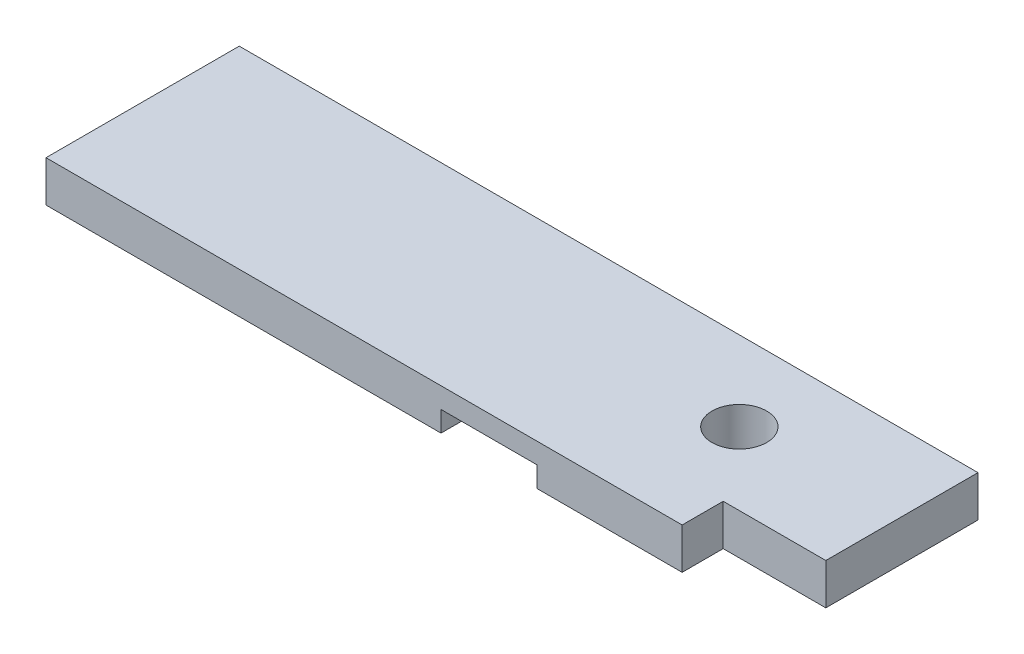
ISO-10303-21;
HEADER;
FILE_DESCRIPTION(('STEP AP214'),'2;1');
FILE_NAME('part.step','',(''),(''),'','','');
FILE_SCHEMA(('AUTOMOTIVE_DESIGN { 1 0 10303 214 1 1 1 1 }'));
ENDSEC;
DATA;
#1=APPLICATION_CONTEXT('core data for automotive mechanical design processes');
#2=APPLICATION_PROTOCOL_DEFINITION('international standard','automotive_design',2000,#1);
#3=PRODUCT_CONTEXT('',#1,'mechanical');
#4=PRODUCT('Part','Part','',(#3));
#5=PRODUCT_RELATED_PRODUCT_CATEGORY('part','',(#4));
#6=PRODUCT_DEFINITION_FORMATION('','',#4);
#7=PRODUCT_DEFINITION_CONTEXT('part definition',#1,'design');
#8=PRODUCT_DEFINITION('design','',#6,#7);
#9=PRODUCT_DEFINITION_SHAPE('','',#8);
#10=(LENGTH_UNIT() NAMED_UNIT(*) SI_UNIT(.MILLI.,.METRE.));
#11=(NAMED_UNIT(*) PLANE_ANGLE_UNIT() SI_UNIT($,.RADIAN.));
#12=(NAMED_UNIT(*) SI_UNIT($,.STERADIAN.) SOLID_ANGLE_UNIT());
#13=UNCERTAINTY_MEASURE_WITH_UNIT(LENGTH_MEASURE(1.E-05),#10,'distance_accuracy_value','');
#14=(GEOMETRIC_REPRESENTATION_CONTEXT(3) GLOBAL_UNCERTAINTY_ASSIGNED_CONTEXT((#13)) GLOBAL_UNIT_ASSIGNED_CONTEXT((#10,
#11,#12)) REPRESENTATION_CONTEXT('',''));
#15=CARTESIAN_POINT('',(0.,0.,0.));
#16=DIRECTION('',(0.,0.,1.));
#17=DIRECTION('',(1.,0.,0.));
#18=AXIS2_PLACEMENT_3D('',#15,#16,#17);
#19=CARTESIAN_POINT('',(0.,0.,0.));
#20=DIRECTION('',(0.,-1.,0.));
#21=DIRECTION('',(0.,0.,-1.));
#22=AXIS2_PLACEMENT_3D('',#19,#20,#21);
#23=PLANE('',#22);
#24=DIRECTION('',(0.,0.,-1.));
#25=VECTOR('',#24,1.);
#26=CARTESIAN_POINT('',(366.70104079,0.,179.400200000003));
#27=LINE('',#26,#25);
#28=CARTESIAN_POINT('',(366.70104079,0.,179.400200000003));
#29=VERTEX_POINT('',#28);
#30=CARTESIAN_POINT('',(366.70104079,0.,0.));
#31=VERTEX_POINT('',#30);
#32=EDGE_CURVE('E201',#29,#31,#27,.T.);
#33=ORIENTED_EDGE('',*,*,#32,.F.);
#34=DIRECTION('',(1.,0.,0.));
#35=VECTOR('',#34,1.);
#36=CARTESIAN_POINT('',(590.5627,0.,179.400200000003));
#37=LINE('',#36,#35);
#38=CARTESIAN_POINT('',(0.,0.,179.400200000003));
#39=VERTEX_POINT('',#38);
#40=EDGE_CURVE('E145',#39,#29,#37,.T.);
#41=ORIENTED_EDGE('',*,*,#40,.F.);
#42=DIRECTION('',(0.,0.,1.));
#43=VECTOR('',#42,1.);
#44=CARTESIAN_POINT('',(0.,0.,0.));
#45=LINE('',#44,#43);
#46=CARTESIAN_POINT('',(0.,0.,0.));
#47=VERTEX_POINT('',#46);
#48=EDGE_CURVE('E140',#47,#39,#45,.T.);
#49=ORIENTED_EDGE('',*,*,#48,.F.);
#50=DIRECTION('',(-1.,0.,0.));
#51=VECTOR('',#50,1.);
#52=CARTESIAN_POINT('',(685.812700000001,0.,0.));
#53=LINE('',#52,#51);
#54=EDGE_CURVE('E92',#31,#47,#53,.T.);
#55=ORIENTED_EDGE('',*,*,#54,.F.);
#56=EDGE_LOOP('',(#33,#41,#49,#55));
#57=FACE_BOUND('',#56,.T.);
#58=ADVANCED_FACE('F41',(#57),#23,.T.);
#59=CARTESIAN_POINT('',(0.,38.1,0.));
#60=DIRECTION('',(0.,-1.,0.));
#61=DIRECTION('',(0.,0.,-1.));
#62=AXIS2_PLACEMENT_3D('',#59,#60,#61);
#63=PLANE('',#62);
#64=DIRECTION('',(0.,0.,1.));
#65=VECTOR('',#64,1.);
#66=CARTESIAN_POINT('',(0.,38.1,0.));
#67=LINE('',#66,#65);
#68=CARTESIAN_POINT('',(0.,38.1,0.));
#69=VERTEX_POINT('',#68);
#70=CARTESIAN_POINT('',(0.,38.1,179.400200000003));
#71=VERTEX_POINT('',#70);
#72=EDGE_CURVE('E156',#69,#71,#67,.T.);
#73=ORIENTED_EDGE('',*,*,#72,.T.);
#74=DIRECTION('',(1.,0.,0.));
#75=VECTOR('',#74,1.);
#76=CARTESIAN_POINT('',(590.5627,38.1,179.400200000003));
#77=LINE('',#76,#75);
#78=CARTESIAN_POINT('',(590.5627,38.1,179.400200000003));
#79=VERTEX_POINT('',#78);
#80=EDGE_CURVE('E100',#71,#79,#77,.T.);
#81=ORIENTED_EDGE('',*,*,#80,.T.);
#82=DIRECTION('',(0.,0.,-1.));
#83=VECTOR('',#82,1.);
#84=CARTESIAN_POINT('',(590.5627,38.1,141.2875));
#85=LINE('',#84,#83);
#86=CARTESIAN_POINT('',(590.5627,38.1,141.2875));
#87=VERTEX_POINT('',#86);
#88=EDGE_CURVE('E118',#79,#87,#85,.T.);
#89=ORIENTED_EDGE('',*,*,#88,.T.);
#90=DIRECTION('',(1.,0.,0.));
#91=VECTOR('',#90,1.);
#92=CARTESIAN_POINT('',(685.812700000001,38.1,141.2875));
#93=LINE('',#92,#91);
#94=CARTESIAN_POINT('',(685.812700000001,38.1,141.2875));
#95=VERTEX_POINT('',#94);
#96=EDGE_CURVE('E110',#87,#95,#93,.T.);
#97=ORIENTED_EDGE('',*,*,#96,.T.);
#98=DIRECTION('',(0.,0.,-1.));
#99=VECTOR('',#98,1.);
#100=CARTESIAN_POINT('',(685.812700000001,38.1,0.));
#101=LINE('',#100,#99);
#102=CARTESIAN_POINT('',(685.812700000001,38.1,0.));
#103=VERTEX_POINT('',#102);
#104=EDGE_CURVE('E115',#95,#103,#101,.T.);
#105=ORIENTED_EDGE('',*,*,#104,.T.);
#106=DIRECTION('',(-1.,0.,0.));
#107=VECTOR('',#106,1.);
#108=CARTESIAN_POINT('',(685.812700000001,38.1,0.));
#109=LINE('',#108,#107);
#110=EDGE_CURVE('E65',#103,#69,#109,.T.);
#111=ORIENTED_EDGE('',*,*,#110,.T.);
#112=EDGE_LOOP('',(#73,#81,#89,#97,#105,#111));
#113=FACE_BOUND('',#112,.T.);
#114=CARTESIAN_POINT('',(538.175199999999,38.1,73.9181909999946));
#115=DIRECTION('',(0.,1.,0.));
#116=DIRECTION('',(0.,0.,1.));
#117=AXIS2_PLACEMENT_3D('',#114,#115,#116);
#118=CIRCLE('',#117,25.4);
#119=CARTESIAN_POINT('',(538.175199999999,38.1,99.3181909999946));
#120=VERTEX_POINT('',#119);
#121=EDGE_CURVE('E144',#120,#120,#118,.T.);
#122=ORIENTED_EDGE('',*,*,#121,.F.);
#123=EDGE_LOOP('',(#122));
#124=FACE_BOUND('',#123,.T.);
#125=ADVANCED_FACE('F112',(#113,#124),#63,.F.);
#126=DIRECTION('',(0.,0.,1.));
#127=VECTOR('',#126,1.);
#128=CARTESIAN_POINT('',(455.60104079,0.,179.400200000003));
#129=LINE('',#128,#127);
#130=CARTESIAN_POINT('',(455.60104079,0.,0.));
#131=VERTEX_POINT('',#130);
#132=CARTESIAN_POINT('',(455.60104079,0.,179.400200000003));
#133=VERTEX_POINT('',#132);
#134=EDGE_CURVE('E198',#131,#133,#129,.T.);
#135=ORIENTED_EDGE('',*,*,#134,.F.);
#136=CARTESIAN_POINT('',(685.812700000001,0.,0.));
#137=VERTEX_POINT('',#136);
#138=EDGE_CURVE('E153',#137,#131,#53,.T.);
#139=ORIENTED_EDGE('',*,*,#138,.F.);
#140=DIRECTION('',(0.,0.,-1.));
#141=VECTOR('',#140,1.);
#142=CARTESIAN_POINT('',(685.812700000001,0.,0.));
#143=LINE('',#142,#141);
#144=CARTESIAN_POINT('',(685.812700000001,0.,141.2875));
#145=VERTEX_POINT('',#144);
#146=EDGE_CURVE('E151',#145,#137,#143,.T.);
#147=ORIENTED_EDGE('',*,*,#146,.F.);
#148=DIRECTION('',(1.,0.,0.));
#149=VECTOR('',#148,1.);
#150=CARTESIAN_POINT('',(685.812700000001,0.,141.2875));
#151=LINE('',#150,#149);
#152=CARTESIAN_POINT('',(590.5627,0.,141.2875));
#153=VERTEX_POINT('',#152);
#154=EDGE_CURVE('E127',#153,#145,#151,.T.);
#155=ORIENTED_EDGE('',*,*,#154,.F.);
#156=DIRECTION('',(0.,0.,-1.));
#157=VECTOR('',#156,1.);
#158=CARTESIAN_POINT('',(590.5627,0.,141.2875));
#159=LINE('',#158,#157);
#160=CARTESIAN_POINT('',(590.5627,0.,179.400200000003));
#161=VERTEX_POINT('',#160);
#162=EDGE_CURVE('E148',#161,#153,#159,.T.);
#163=ORIENTED_EDGE('',*,*,#162,.F.);
#164=EDGE_CURVE('E143',#133,#161,#37,.T.);
#165=ORIENTED_EDGE('',*,*,#164,.F.);
#166=EDGE_LOOP('',(#135,#139,#147,#155,#163,#165));
#167=FACE_BOUND('',#166,.T.);
#168=CARTESIAN_POINT('',(538.175199999999,0.,73.9181909999946));
#169=DIRECTION('',(0.,1.,0.));
#170=DIRECTION('',(0.,0.,1.));
#171=AXIS2_PLACEMENT_3D('',#168,#169,#170);
#172=CIRCLE('',#171,25.4);
#173=CARTESIAN_POINT('',(538.175199999999,0.,99.3181909999946));
#174=VERTEX_POINT('',#173);
#175=EDGE_CURVE('E181',#174,#174,#172,.T.);
#176=ORIENTED_EDGE('',*,*,#175,.T.);
#177=EDGE_LOOP('',(#176));
#178=FACE_BOUND('',#177,.T.);
#179=ADVANCED_FACE('F166',(#167,#178),#23,.T.);
#180=CARTESIAN_POINT('',(0.,38.1,0.));
#181=DIRECTION('',(1.,0.,0.));
#182=DIRECTION('',(0.,0.,-1.));
#183=AXIS2_PLACEMENT_3D('',#180,#181,#182);
#184=PLANE('',#183);
#185=ORIENTED_EDGE('',*,*,#48,.T.);
#186=DIRECTION('',(0.,-1.,0.));
#187=VECTOR('',#186,1.);
#188=CARTESIAN_POINT('',(0.,38.1,179.400200000003));
#189=LINE('',#188,#187);
#190=EDGE_CURVE('E11',#71,#39,#189,.T.);
#191=ORIENTED_EDGE('',*,*,#190,.F.);
#192=ORIENTED_EDGE('',*,*,#72,.F.);
#193=DIRECTION('',(0.,-1.,0.));
#194=VECTOR('',#193,1.);
#195=CARTESIAN_POINT('',(0.,38.1,0.));
#196=LINE('',#195,#194);
#197=EDGE_CURVE('E136',#69,#47,#196,.T.);
#198=ORIENTED_EDGE('',*,*,#197,.T.);
#199=EDGE_LOOP('',(#185,#191,#192,#198));
#200=FACE_BOUND('',#199,.T.);
#201=ADVANCED_FACE('F43',(#200),#184,.F.);
#202=CARTESIAN_POINT('',(590.5627,38.1,179.400200000003));
#203=DIRECTION('',(0.,0.,-1.));
#204=DIRECTION('',(-1.,0.,0.));
#205=AXIS2_PLACEMENT_3D('',#202,#203,#204);
#206=PLANE('',#205);
#207=ORIENTED_EDGE('',*,*,#40,.T.);
#208=DIRECTION('',(0.,-1.,0.));
#209=VECTOR('',#208,1.);
#210=CARTESIAN_POINT('',(366.70104079,19.05,179.400200000003));
#211=LINE('',#210,#209);
#212=CARTESIAN_POINT('',(366.70104079,19.05,179.400200000003));
#213=VERTEX_POINT('',#212);
#214=EDGE_CURVE('E184',#213,#29,#211,.T.);
#215=ORIENTED_EDGE('',*,*,#214,.F.);
#216=DIRECTION('',(-1.,0.,0.));
#217=VECTOR('',#216,1.);
#218=CARTESIAN_POINT('',(366.70104079,19.05,179.400200000003));
#219=LINE('',#218,#217);
#220=CARTESIAN_POINT('',(455.60104079,19.05,179.400200000003));
#221=VERTEX_POINT('',#220);
#222=EDGE_CURVE('E190',#221,#213,#219,.T.);
#223=ORIENTED_EDGE('',*,*,#222,.F.);
#224=DIRECTION('',(0.,-1.,0.));
#225=VECTOR('',#224,1.);
#226=CARTESIAN_POINT('',(455.60104079,19.05,179.400200000003));
#227=LINE('',#226,#225);
#228=EDGE_CURVE('E193',#221,#133,#227,.T.);
#229=ORIENTED_EDGE('',*,*,#228,.T.);
#230=ORIENTED_EDGE('',*,*,#164,.T.);
#231=DIRECTION('',(0.,-1.,0.));
#232=VECTOR('',#231,1.);
#233=CARTESIAN_POINT('',(590.5627,38.1,179.400200000003));
#234=LINE('',#233,#232);
#235=EDGE_CURVE('E49',#79,#161,#234,.T.);
#236=ORIENTED_EDGE('',*,*,#235,.F.);
#237=ORIENTED_EDGE('',*,*,#80,.F.);
#238=ORIENTED_EDGE('',*,*,#190,.T.);
#239=EDGE_LOOP('',(#207,#215,#223,#229,#230,#236,#237,#238));
#240=FACE_BOUND('',#239,.T.);
#241=ADVANCED_FACE('F224',(#240),#206,.F.);
#242=CARTESIAN_POINT('',(590.5627,38.1,141.2875));
#243=DIRECTION('',(-1.,0.,0.));
#244=DIRECTION('',(0.,0.,1.));
#245=AXIS2_PLACEMENT_3D('',#242,#243,#244);
#246=PLANE('',#245);
#247=ORIENTED_EDGE('',*,*,#162,.T.);
#248=DIRECTION('',(0.,-1.,0.));
#249=VECTOR('',#248,1.);
#250=CARTESIAN_POINT('',(590.5627,38.1,141.2875));
#251=LINE('',#250,#249);
#252=EDGE_CURVE('E130',#87,#153,#251,.T.);
#253=ORIENTED_EDGE('',*,*,#252,.F.);
#254=ORIENTED_EDGE('',*,*,#88,.F.);
#255=ORIENTED_EDGE('',*,*,#235,.T.);
#256=EDGE_LOOP('',(#247,#253,#254,#255));
#257=FACE_BOUND('',#256,.T.);
#258=ADVANCED_FACE('F162',(#257),#246,.F.);
#259=CARTESIAN_POINT('',(685.812700000001,38.1,141.2875));
#260=DIRECTION('',(0.,0.,-1.));
#261=DIRECTION('',(-1.,0.,0.));
#262=AXIS2_PLACEMENT_3D('',#259,#260,#261);
#263=PLANE('',#262);
#264=ORIENTED_EDGE('',*,*,#154,.T.);
#265=DIRECTION('',(0.,-1.,0.));
#266=VECTOR('',#265,1.);
#267=CARTESIAN_POINT('',(685.812700000001,38.1,141.2875));
#268=LINE('',#267,#266);
#269=EDGE_CURVE('E124',#95,#145,#268,.T.);
#270=ORIENTED_EDGE('',*,*,#269,.F.);
#271=ORIENTED_EDGE('',*,*,#96,.F.);
#272=ORIENTED_EDGE('',*,*,#252,.T.);
#273=EDGE_LOOP('',(#264,#270,#271,#272));
#274=FACE_BOUND('',#273,.T.);
#275=ADVANCED_FACE('F125',(#274),#263,.F.);
#276=CARTESIAN_POINT('',(685.812700000001,38.1,0.));
#277=DIRECTION('',(-1.,0.,0.));
#278=DIRECTION('',(0.,0.,1.));
#279=AXIS2_PLACEMENT_3D('',#276,#277,#278);
#280=PLANE('',#279);
#281=ORIENTED_EDGE('',*,*,#146,.T.);
#282=DIRECTION('',(0.,-1.,0.));
#283=VECTOR('',#282,1.);
#284=CARTESIAN_POINT('',(685.812700000001,38.1,0.));
#285=LINE('',#284,#283);
#286=EDGE_CURVE('E131',#103,#137,#285,.T.);
#287=ORIENTED_EDGE('',*,*,#286,.F.);
#288=ORIENTED_EDGE('',*,*,#104,.F.);
#289=ORIENTED_EDGE('',*,*,#269,.T.);
#290=EDGE_LOOP('',(#281,#287,#288,#289));
#291=FACE_BOUND('',#290,.T.);
#292=ADVANCED_FACE('F133',(#291),#280,.F.);
#293=CARTESIAN_POINT('',(685.812700000001,38.1,0.));
#294=DIRECTION('',(0.,0.,1.));
#295=DIRECTION('',(1.,0.,0.));
#296=AXIS2_PLACEMENT_3D('',#293,#294,#295);
#297=PLANE('',#296);
#298=DIRECTION('',(1.,0.,0.));
#299=VECTOR('',#298,1.);
#300=CARTESIAN_POINT('',(366.70104079,19.05,0.));
#301=LINE('',#300,#299);
#302=CARTESIAN_POINT('',(366.70104079,19.05,0.));
#303=VERTEX_POINT('',#302);
#304=CARTESIAN_POINT('',(455.60104079,19.05,0.));
#305=VERTEX_POINT('',#304);
#306=EDGE_CURVE('E208',#303,#305,#301,.T.);
#307=ORIENTED_EDGE('',*,*,#306,.F.);
#308=DIRECTION('',(0.,-1.,0.));
#309=VECTOR('',#308,1.);
#310=CARTESIAN_POINT('',(366.70104079,19.05,0.));
#311=LINE('',#310,#309);
#312=EDGE_CURVE('E187',#303,#31,#311,.T.);
#313=ORIENTED_EDGE('',*,*,#312,.T.);
#314=ORIENTED_EDGE('',*,*,#54,.T.);
#315=ORIENTED_EDGE('',*,*,#197,.F.);
#316=ORIENTED_EDGE('',*,*,#110,.F.);
#317=ORIENTED_EDGE('',*,*,#286,.T.);
#318=ORIENTED_EDGE('',*,*,#138,.T.);
#319=DIRECTION('',(0.,-1.,0.));
#320=VECTOR('',#319,1.);
#321=CARTESIAN_POINT('',(455.60104079,19.05,0.));
#322=LINE('',#321,#320);
#323=EDGE_CURVE('E189',#305,#131,#322,.T.);
#324=ORIENTED_EDGE('',*,*,#323,.F.);
#325=EDGE_LOOP('',(#307,#313,#314,#315,#316,#317,#318,#324));
#326=FACE_BOUND('',#325,.T.);
#327=ADVANCED_FACE('F171',(#326),#297,.F.);
#328=CARTESIAN_POINT('',(538.175199999999,38.1,73.9181909999946));
#329=DIRECTION('',(0.,-1.,0.));
#330=DIRECTION('',(0.,0.,-1.));
#331=AXIS2_PLACEMENT_3D('',#328,#329,#330);
#332=CYLINDRICAL_SURFACE('',#331,25.4);
#333=ORIENTED_EDGE('',*,*,#121,.T.);
#334=EDGE_LOOP('',(#333));
#335=FACE_BOUND('',#334,.T.);
#336=ORIENTED_EDGE('',*,*,#175,.F.);
#337=EDGE_LOOP('',(#336));
#338=FACE_BOUND('',#337,.T.);
#339=ADVANCED_FACE('F254',(#335,#338),#332,.F.);
#340=CARTESIAN_POINT('',(366.70104079,19.05,179.400200000003));
#341=DIRECTION('',(-1.,0.,0.));
#342=DIRECTION('',(0.,0.,1.));
#343=AXIS2_PLACEMENT_3D('',#340,#341,#342);
#344=PLANE('',#343);
#345=ORIENTED_EDGE('',*,*,#32,.T.);
#346=ORIENTED_EDGE('',*,*,#312,.F.);
#347=DIRECTION('',(0.,0.,-1.));
#348=VECTOR('',#347,1.);
#349=CARTESIAN_POINT('',(366.70104079,19.05,179.400200000003));
#350=LINE('',#349,#348);
#351=EDGE_CURVE('E56',#213,#303,#350,.T.);
#352=ORIENTED_EDGE('',*,*,#351,.F.);
#353=ORIENTED_EDGE('',*,*,#214,.T.);
#354=EDGE_LOOP('',(#345,#346,#352,#353));
#355=FACE_BOUND('',#354,.T.);
#356=ADVANCED_FACE('F228',(#355),#344,.F.);
#357=CARTESIAN_POINT('',(455.60104079,19.05,179.400200000003));
#358=DIRECTION('',(1.,0.,0.));
#359=DIRECTION('',(0.,0.,-1.));
#360=AXIS2_PLACEMENT_3D('',#357,#358,#359);
#361=PLANE('',#360);
#362=ORIENTED_EDGE('',*,*,#134,.T.);
#363=ORIENTED_EDGE('',*,*,#228,.F.);
#364=DIRECTION('',(0.,0.,1.));
#365=VECTOR('',#364,1.);
#366=CARTESIAN_POINT('',(455.60104079,19.05,179.400200000003));
#367=LINE('',#366,#365);
#368=EDGE_CURVE('E205',#305,#221,#367,.T.);
#369=ORIENTED_EDGE('',*,*,#368,.F.);
#370=ORIENTED_EDGE('',*,*,#323,.T.);
#371=EDGE_LOOP('',(#362,#363,#369,#370));
#372=FACE_BOUND('',#371,.T.);
#373=ADVANCED_FACE('F217',(#372),#361,.F.);
#374=CARTESIAN_POINT('',(0.,19.05,0.));
#375=DIRECTION('',(0.,-1.,0.));
#376=DIRECTION('',(0.,0.,-1.));
#377=AXIS2_PLACEMENT_3D('',#374,#375,#376);
#378=PLANE('',#377);
#379=ORIENTED_EDGE('',*,*,#351,.T.);
#380=ORIENTED_EDGE('',*,*,#306,.T.);
#381=ORIENTED_EDGE('',*,*,#368,.T.);
#382=ORIENTED_EDGE('',*,*,#222,.T.);
#383=EDGE_LOOP('',(#379,#380,#381,#382));
#384=FACE_BOUND('',#383,.T.);
#385=ADVANCED_FACE('F211',(#384),#378,.T.);
#386=CLOSED_SHELL('',(#58,#125,#179,#201,#241,#258,#275,#292,#327,#339,#356,#373,#385));
#387=MANIFOLD_SOLID_BREP('B2',#386);
#388=ADVANCED_BREP_SHAPE_REPRESENTATION('',(#18,#387),#14);
#389=SHAPE_DEFINITION_REPRESENTATION(#9,#388);
ENDSEC;
END-ISO-10303-21;
